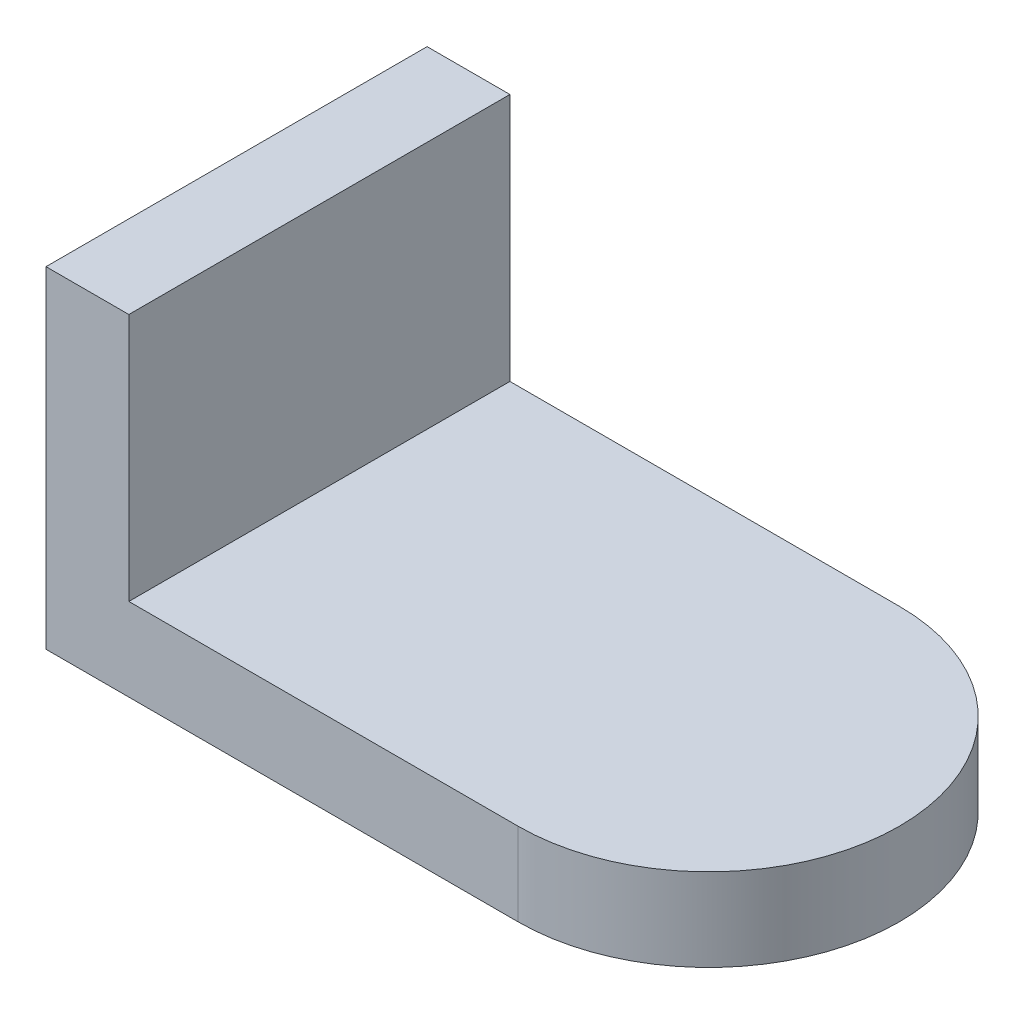
ISO-10303-21;
HEADER;
FILE_DESCRIPTION(('STEP AP214'),'2;1');
FILE_NAME('part.step','',(''),(''),'','','');
FILE_SCHEMA(('AUTOMOTIVE_DESIGN { 1 0 10303 214 1 1 1 1 }'));
ENDSEC;
DATA;
#1=APPLICATION_CONTEXT('core data for automotive mechanical design processes');
#2=APPLICATION_PROTOCOL_DEFINITION('international standard','automotive_design',2000,#1);
#3=PRODUCT_CONTEXT('',#1,'mechanical');
#4=PRODUCT('Part','Part','',(#3));
#5=PRODUCT_RELATED_PRODUCT_CATEGORY('part','',(#4));
#6=PRODUCT_DEFINITION_FORMATION('','',#4);
#7=PRODUCT_DEFINITION_CONTEXT('part definition',#1,'design');
#8=PRODUCT_DEFINITION('design','',#6,#7);
#9=PRODUCT_DEFINITION_SHAPE('','',#8);
#10=(LENGTH_UNIT() NAMED_UNIT(*) SI_UNIT(.MILLI.,.METRE.));
#11=(NAMED_UNIT(*) PLANE_ANGLE_UNIT() SI_UNIT($,.RADIAN.));
#12=(NAMED_UNIT(*) SI_UNIT($,.STERADIAN.) SOLID_ANGLE_UNIT());
#13=UNCERTAINTY_MEASURE_WITH_UNIT(LENGTH_MEASURE(1.E-05),#10,'distance_accuracy_value','');
#14=(GEOMETRIC_REPRESENTATION_CONTEXT(3) GLOBAL_UNCERTAINTY_ASSIGNED_CONTEXT((#13)) GLOBAL_UNIT_ASSIGNED_CONTEXT((#10,
#11,#12)) REPRESENTATION_CONTEXT('',''));
#15=CARTESIAN_POINT('',(0.,0.,0.));
#16=DIRECTION('',(0.,0.,1.));
#17=DIRECTION('',(1.,0.,0.));
#18=AXIS2_PLACEMENT_3D('',#15,#16,#17);
#19=CARTESIAN_POINT('',(-1.45,-0.2,-0.864999999999999));
#20=DIRECTION('',(0.,0.,-1.));
#21=DIRECTION('',(-1.,0.,0.));
#22=AXIS2_PLACEMENT_3D('',#19,#20,#21);
#23=PLANE('',#22);
#24=DIRECTION('',(0.,-1.,0.));
#25=VECTOR('',#24,1.);
#26=CARTESIAN_POINT('',(-1.5,-0.2,-0.864999999999999));
#27=LINE('',#26,#25);
#28=CARTESIAN_POINT('',(-1.5,-0.2,-0.864999999999999));
#29=VERTEX_POINT('',#28);
#30=CARTESIAN_POINT('',(-1.5,-0.4,-0.864999999999999));
#31=VERTEX_POINT('',#30);
#32=EDGE_CURVE('E11',#29,#31,#27,.T.);
#33=ORIENTED_EDGE('',*,*,#32,.F.);
#34=DIRECTION('',(-1.,0.,0.));
#35=VECTOR('',#34,1.);
#36=CARTESIAN_POINT('',(-1.45,-0.2,-0.864999999999999));
#37=LINE('',#36,#35);
#38=CARTESIAN_POINT('',(-1.45,-0.2,-0.864999999999999));
#39=VERTEX_POINT('',#38);
#40=EDGE_CURVE('E24',#39,#29,#37,.T.);
#41=ORIENTED_EDGE('',*,*,#40,.F.);
#42=DIRECTION('',(0.,-1.,0.));
#43=VECTOR('',#42,1.);
#44=CARTESIAN_POINT('',(-1.45,-0.2,-0.864999999999999));
#45=LINE('',#44,#43);
#46=CARTESIAN_POINT('',(-1.45,-0.35,-0.864999999999999));
#47=VERTEX_POINT('',#46);
#48=EDGE_CURVE('E116',#39,#47,#45,.T.);
#49=ORIENTED_EDGE('',*,*,#48,.T.);
#50=DIRECTION('',(1.,0.,0.));
#51=VECTOR('',#50,1.);
#52=CARTESIAN_POINT('',(-1.45,-0.35,-0.864999999999999));
#53=LINE('',#52,#51);
#54=CARTESIAN_POINT('',(-1.215,-0.35,-0.864999999999999));
#55=VERTEX_POINT('',#54);
#56=EDGE_CURVE('E90',#47,#55,#53,.T.);
#57=ORIENTED_EDGE('',*,*,#56,.T.);
#58=DIRECTION('',(0.,-1.,0.));
#59=VECTOR('',#58,1.);
#60=CARTESIAN_POINT('',(-1.215,-0.35,-0.864999999999999));
#61=LINE('',#60,#59);
#62=CARTESIAN_POINT('',(-1.215,-0.4,-0.864999999999999));
#63=VERTEX_POINT('',#62);
#64=EDGE_CURVE('E113',#55,#63,#61,.T.);
#65=ORIENTED_EDGE('',*,*,#64,.T.);
#66=DIRECTION('',(-1.,0.,0.));
#67=VECTOR('',#66,1.);
#68=CARTESIAN_POINT('',(-1.45,-0.4,-0.864999999999999));
#69=LINE('',#68,#67);
#70=EDGE_CURVE('E111',#63,#31,#69,.T.);
#71=ORIENTED_EDGE('',*,*,#70,.T.);
#72=EDGE_LOOP('',(#33,#41,#49,#57,#65,#71));
#73=FACE_BOUND('',#72,.T.);
#74=ADVANCED_FACE('F17',(#73),#23,.T.);
#75=CARTESIAN_POINT('',(-1.45,-0.2,-0.864999999999999));
#76=DIRECTION('',(0.,1.,0.));
#77=DIRECTION('',(0.,0.,1.));
#78=AXIS2_PLACEMENT_3D('',#75,#76,#77);
#79=PLANE('',#78);
#80=DIRECTION('',(0.,0.,-1.));
#81=VECTOR('',#80,1.);
#82=CARTESIAN_POINT('',(-1.5,-0.2,-0.864999999999999));
#83=LINE('',#82,#81);
#84=CARTESIAN_POINT('',(-1.5,-0.2,-0.635));
#85=VERTEX_POINT('',#84);
#86=EDGE_CURVE('E109',#85,#29,#83,.T.);
#87=ORIENTED_EDGE('',*,*,#86,.F.);
#88=DIRECTION('',(-1.,0.,0.));
#89=VECTOR('',#88,1.);
#90=CARTESIAN_POINT('',(-1.45,-0.2,-0.635));
#91=LINE('',#90,#89);
#92=CARTESIAN_POINT('',(-1.45,-0.2,-0.635));
#93=VERTEX_POINT('',#92);
#94=EDGE_CURVE('E107',#93,#85,#91,.T.);
#95=ORIENTED_EDGE('',*,*,#94,.F.);
#96=DIRECTION('',(0.,0.,-1.));
#97=VECTOR('',#96,1.);
#98=CARTESIAN_POINT('',(-1.45,-0.2,-0.864999999999999));
#99=LINE('',#98,#97);
#100=EDGE_CURVE('E85',#93,#39,#99,.T.);
#101=ORIENTED_EDGE('',*,*,#100,.T.);
#102=ORIENTED_EDGE('',*,*,#40,.T.);
#103=EDGE_LOOP('',(#87,#95,#101,#102));
#104=FACE_BOUND('',#103,.T.);
#105=ADVANCED_FACE('F118',(#104),#79,.T.);
#106=CARTESIAN_POINT('',(-1.45,-0.2,-0.635));
#107=DIRECTION('',(0.,0.,1.));
#108=DIRECTION('',(0.,-1.,0.));
#109=AXIS2_PLACEMENT_3D('',#106,#107,#108);
#110=PLANE('',#109);
#111=DIRECTION('',(0.,1.,0.));
#112=VECTOR('',#111,1.);
#113=CARTESIAN_POINT('',(-1.5,-0.2,-0.635));
#114=LINE('',#113,#112);
#115=CARTESIAN_POINT('',(-1.5,-0.4,-0.635));
#116=VERTEX_POINT('',#115);
#117=EDGE_CURVE('E103',#116,#85,#114,.T.);
#118=ORIENTED_EDGE('',*,*,#117,.F.);
#119=DIRECTION('',(-1.,0.,0.));
#120=VECTOR('',#119,1.);
#121=CARTESIAN_POINT('',(-1.45,-0.4,-0.635));
#122=LINE('',#121,#120);
#123=CARTESIAN_POINT('',(-1.215,-0.4,-0.635));
#124=VERTEX_POINT('',#123);
#125=EDGE_CURVE('E100',#124,#116,#122,.T.);
#126=ORIENTED_EDGE('',*,*,#125,.F.);
#127=DIRECTION('',(0.,-1.,0.));
#128=VECTOR('',#127,1.);
#129=CARTESIAN_POINT('',(-1.215,-0.35,-0.635));
#130=LINE('',#129,#128);
#131=CARTESIAN_POINT('',(-1.215,-0.35,-0.635));
#132=VERTEX_POINT('',#131);
#133=EDGE_CURVE('E72',#132,#124,#130,.T.);
#134=ORIENTED_EDGE('',*,*,#133,.F.);
#135=DIRECTION('',(-1.,0.,0.));
#136=VECTOR('',#135,1.);
#137=CARTESIAN_POINT('',(-1.45,-0.35,-0.635));
#138=LINE('',#137,#136);
#139=CARTESIAN_POINT('',(-1.45,-0.35,-0.635));
#140=VERTEX_POINT('',#139);
#141=EDGE_CURVE('E66',#132,#140,#138,.T.);
#142=ORIENTED_EDGE('',*,*,#141,.T.);
#143=DIRECTION('',(0.,1.,0.));
#144=VECTOR('',#143,1.);
#145=CARTESIAN_POINT('',(-1.45,-0.2,-0.635));
#146=LINE('',#145,#144);
#147=EDGE_CURVE('E70',#140,#93,#146,.T.);
#148=ORIENTED_EDGE('',*,*,#147,.T.);
#149=ORIENTED_EDGE('',*,*,#94,.T.);
#150=EDGE_LOOP('',(#118,#126,#134,#142,#148,#149));
#151=FACE_BOUND('',#150,.T.);
#152=ADVANCED_FACE('F68',(#151),#110,.T.);
#153=CARTESIAN_POINT('',(-1.45,-0.4,-0.864999999999999));
#154=DIRECTION('',(0.,-1.,0.));
#155=DIRECTION('',(0.,0.,-1.));
#156=AXIS2_PLACEMENT_3D('',#153,#154,#155);
#157=PLANE('',#156);
#158=DIRECTION('',(0.,0.,1.));
#159=VECTOR('',#158,1.);
#160=CARTESIAN_POINT('',(-1.5,-0.4,-0.864999999999999));
#161=LINE('',#160,#159);
#162=EDGE_CURVE('E86',#31,#116,#161,.T.);
#163=ORIENTED_EDGE('',*,*,#162,.F.);
#164=ORIENTED_EDGE('',*,*,#70,.F.);
#165=CARTESIAN_POINT('',(-1.215,-0.4,-0.749999999999999));
#166=DIRECTION('',(0.,-1.,0.));
#167=DIRECTION('',(0.,0.,1.));
#168=AXIS2_PLACEMENT_3D('',#165,#166,#167);
#169=CIRCLE('',#168,0.115);
#170=EDGE_CURVE('E91',#63,#124,#169,.T.);
#171=ORIENTED_EDGE('',*,*,#170,.T.);
#172=ORIENTED_EDGE('',*,*,#125,.T.);
#173=EDGE_LOOP('',(#163,#164,#171,#172));
#174=FACE_BOUND('',#173,.T.);
#175=ADVANCED_FACE('F122',(#174),#157,.T.);
#176=CARTESIAN_POINT('',(-1.45,0.,0.));
#177=DIRECTION('',(-1.,0.,0.));
#178=DIRECTION('',(0.,0.,1.));
#179=AXIS2_PLACEMENT_3D('',#176,#177,#178);
#180=PLANE('',#179);
#181=ORIENTED_EDGE('',*,*,#147,.F.);
#182=DIRECTION('',(0.,0.,-1.));
#183=VECTOR('',#182,1.);
#184=CARTESIAN_POINT('',(-1.45,-0.35,-0.864999999999999));
#185=LINE('',#184,#183);
#186=EDGE_CURVE('E83',#140,#47,#185,.T.);
#187=ORIENTED_EDGE('',*,*,#186,.T.);
#188=ORIENTED_EDGE('',*,*,#48,.F.);
#189=ORIENTED_EDGE('',*,*,#100,.F.);
#190=EDGE_LOOP('',(#181,#187,#188,#189));
#191=FACE_BOUND('',#190,.T.);
#192=ADVANCED_FACE('F81',(#191),#180,.F.);
#193=CARTESIAN_POINT('',(-1.5,0.,0.));
#194=DIRECTION('',(-1.,0.,0.));
#195=DIRECTION('',(0.,0.,1.));
#196=AXIS2_PLACEMENT_3D('',#193,#194,#195);
#197=PLANE('',#196);
#198=ORIENTED_EDGE('',*,*,#32,.T.);
#199=ORIENTED_EDGE('',*,*,#162,.T.);
#200=ORIENTED_EDGE('',*,*,#117,.T.);
#201=ORIENTED_EDGE('',*,*,#86,.T.);
#202=EDGE_LOOP('',(#198,#199,#200,#201));
#203=FACE_BOUND('',#202,.T.);
#204=ADVANCED_FACE('F119',(#203),#197,.T.);
#205=CARTESIAN_POINT('',(-1.215,-0.35,-0.749999999999999));
#206=DIRECTION('',(0.,-1.,0.));
#207=DIRECTION('',(0.,0.,-1.));
#208=AXIS2_PLACEMENT_3D('',#205,#206,#207);
#209=CYLINDRICAL_SURFACE('',#208,0.115);
#210=ORIENTED_EDGE('',*,*,#170,.F.);
#211=ORIENTED_EDGE('',*,*,#64,.F.);
#212=CARTESIAN_POINT('',(-1.215,-0.35,-0.749999999999999));
#213=DIRECTION('',(0.,-1.,0.));
#214=DIRECTION('',(0.,0.,1.));
#215=AXIS2_PLACEMENT_3D('',#212,#213,#214);
#216=CIRCLE('',#215,0.115);
#217=EDGE_CURVE('E92',#55,#132,#216,.T.);
#218=ORIENTED_EDGE('',*,*,#217,.T.);
#219=ORIENTED_EDGE('',*,*,#133,.T.);
#220=EDGE_LOOP('',(#210,#211,#218,#219));
#221=FACE_BOUND('',#220,.T.);
#222=ADVANCED_FACE('F127',(#221),#209,.T.);
#223=CARTESIAN_POINT('',(-1.215,-0.35,-0.749999999999999));
#224=DIRECTION('',(0.,1.,0.));
#225=DIRECTION('',(0.,0.,1.));
#226=AXIS2_PLACEMENT_3D('',#223,#224,#225);
#227=PLANE('',#226);
#228=ORIENTED_EDGE('',*,*,#186,.F.);
#229=ORIENTED_EDGE('',*,*,#141,.F.);
#230=ORIENTED_EDGE('',*,*,#217,.F.);
#231=ORIENTED_EDGE('',*,*,#56,.F.);
#232=EDGE_LOOP('',(#228,#229,#230,#231));
#233=FACE_BOUND('',#232,.T.);
#234=ADVANCED_FACE('F89',(#233),#227,.T.);
#235=CLOSED_SHELL('',(#74,#105,#152,#175,#192,#204,#222,#234));
#236=MANIFOLD_SOLID_BREP('B1',#235);
#237=ADVANCED_BREP_SHAPE_REPRESENTATION('',(#18,#236),#14);
#238=SHAPE_DEFINITION_REPRESENTATION(#9,#237);
ENDSEC;
END-ISO-10303-21;
